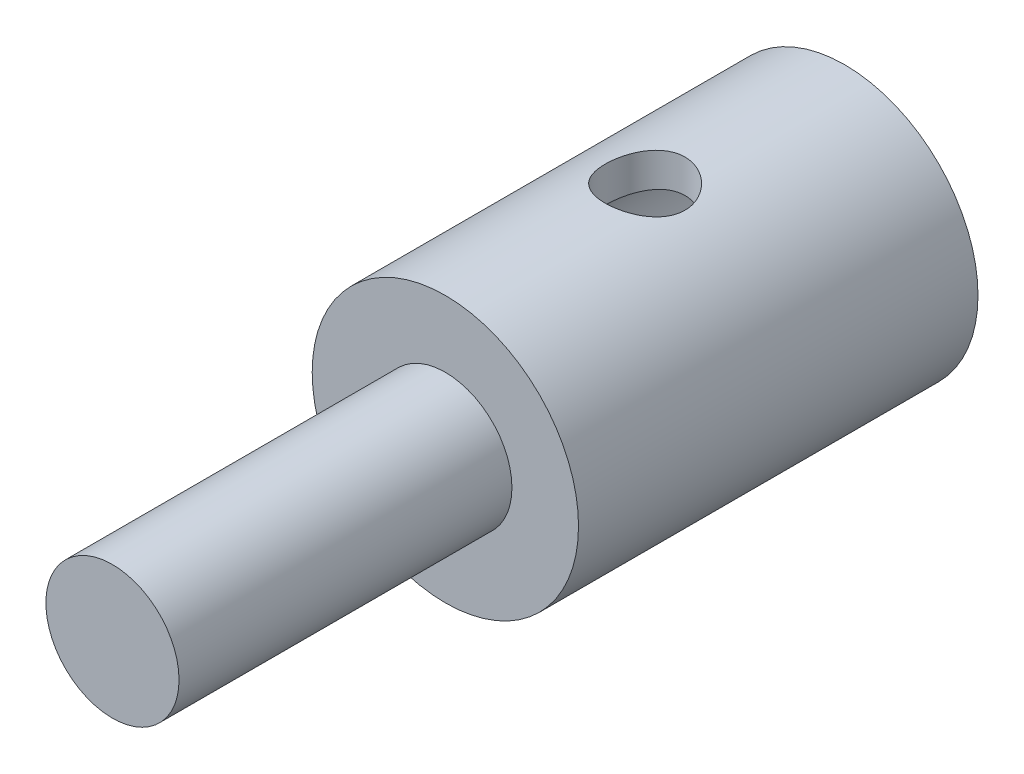
ISO-10303-21;
HEADER;
FILE_DESCRIPTION(('STEP AP214'),'2;1');
FILE_NAME('part.step','',(''),(''),'','','');
FILE_SCHEMA(('AUTOMOTIVE_DESIGN { 1 0 10303 214 1 1 1 1 }'));
ENDSEC;
DATA;
#1=APPLICATION_CONTEXT('core data for automotive mechanical design processes');
#2=APPLICATION_PROTOCOL_DEFINITION('international standard','automotive_design',2000,#1);
#3=PRODUCT_CONTEXT('',#1,'mechanical');
#4=PRODUCT('Part','Part','',(#3));
#5=PRODUCT_RELATED_PRODUCT_CATEGORY('part','',(#4));
#6=PRODUCT_DEFINITION_FORMATION('','',#4);
#7=PRODUCT_DEFINITION_CONTEXT('part definition',#1,'design');
#8=PRODUCT_DEFINITION('design','',#6,#7);
#9=PRODUCT_DEFINITION_SHAPE('','',#8);
#10=(LENGTH_UNIT() NAMED_UNIT(*) SI_UNIT(.MILLI.,.METRE.));
#11=(NAMED_UNIT(*) PLANE_ANGLE_UNIT() SI_UNIT($,.RADIAN.));
#12=(NAMED_UNIT(*) SI_UNIT($,.STERADIAN.) SOLID_ANGLE_UNIT());
#13=UNCERTAINTY_MEASURE_WITH_UNIT(LENGTH_MEASURE(1.E-05),#10,'distance_accuracy_value','');
#14=(GEOMETRIC_REPRESENTATION_CONTEXT(3) GLOBAL_UNCERTAINTY_ASSIGNED_CONTEXT((#13)) GLOBAL_UNIT_ASSIGNED_CONTEXT((#10,
#11,#12)) REPRESENTATION_CONTEXT('',''));
#15=CARTESIAN_POINT('',(0.,0.,0.));
#16=DIRECTION('',(0.,0.,1.));
#17=DIRECTION('',(1.,0.,0.));
#18=AXIS2_PLACEMENT_3D('',#15,#16,#17);
#19=CARTESIAN_POINT('',(0.,0.,5.5));
#20=DIRECTION('',(0.,0.,-1.));
#21=DIRECTION('',(-1.,0.,0.));
#22=AXIS2_PLACEMENT_3D('',#19,#20,#21);
#23=PLANE('',#22);
#24=CARTESIAN_POINT('',(0.,0.,5.5));
#25=DIRECTION('',(0.,0.,1.));
#26=DIRECTION('',(1.,0.,0.));
#27=AXIS2_PLACEMENT_3D('',#24,#25,#26);
#28=CIRCLE('',#27,1.);
#29=CARTESIAN_POINT('',(1.,0.,5.5));
#30=VERTEX_POINT('',#29);
#31=EDGE_CURVE('E10',#30,#30,#28,.T.);
#32=ORIENTED_EDGE('',*,*,#31,.T.);
#33=EDGE_LOOP('',(#32));
#34=FACE_BOUND('',#33,.T.);
#35=ADVANCED_FACE('F31',(#34),#23,.F.);
#36=CARTESIAN_POINT('',(0.,0.,5.5));
#37=DIRECTION('',(0.,0.,1.));
#38=DIRECTION('',(1.,0.,0.));
#39=AXIS2_PLACEMENT_3D('',#36,#37,#38);
#40=CYLINDRICAL_SURFACE('',#39,1.);
#41=ORIENTED_EDGE('',*,*,#31,.F.);
#42=EDGE_LOOP('',(#41));
#43=FACE_BOUND('',#42,.T.);
#44=CARTESIAN_POINT('',(0.,0.,0.5));
#45=DIRECTION('',(0.,0.,1.));
#46=DIRECTION('',(1.,0.,0.));
#47=AXIS2_PLACEMENT_3D('',#44,#45,#46);
#48=CIRCLE('',#47,1.);
#49=CARTESIAN_POINT('',(1.,0.,0.5));
#50=VERTEX_POINT('',#49);
#51=EDGE_CURVE('E43',#50,#50,#48,.T.);
#52=ORIENTED_EDGE('',*,*,#51,.T.);
#53=EDGE_LOOP('',(#52));
#54=FACE_BOUND('',#53,.T.);
#55=ADVANCED_FACE('F91',(#43,#54),#40,.T.);
#56=CARTESIAN_POINT('',(0.,1.,0.5));
#57=DIRECTION('',(0.,0.,-1.));
#58=DIRECTION('',(-1.,0.,0.));
#59=AXIS2_PLACEMENT_3D('',#56,#57,#58);
#60=PLANE('',#59);
#61=ORIENTED_EDGE('',*,*,#51,.F.);
#62=EDGE_LOOP('',(#61));
#63=FACE_BOUND('',#62,.T.);
#64=CARTESIAN_POINT('',(0.,0.,0.5));
#65=DIRECTION('',(0.,0.,1.));
#66=DIRECTION('',(1.,0.,0.));
#67=AXIS2_PLACEMENT_3D('',#64,#65,#66);
#68=CIRCLE('',#67,2.);
#69=CARTESIAN_POINT('',(2.,0.,0.5));
#70=VERTEX_POINT('',#69);
#71=EDGE_CURVE('E48',#70,#70,#68,.T.);
#72=ORIENTED_EDGE('',*,*,#71,.T.);
#73=EDGE_LOOP('',(#72));
#74=FACE_BOUND('',#73,.T.);
#75=ADVANCED_FACE('F87',(#63,#74),#60,.F.);
#76=CARTESIAN_POINT('',(0.,0.,5.5));
#77=DIRECTION('',(0.,0.,1.));
#78=DIRECTION('',(1.,0.,0.));
#79=AXIS2_PLACEMENT_3D('',#76,#77,#78);
#80=CYLINDRICAL_SURFACE('',#79,2.);
#81=CARTESIAN_POINT('',(0.,-2.,-1.9));
#82=CARTESIAN_POINT('',(0.03291544510132,-1.9999997170022,-1.90000039899395));
#83=CARTESIAN_POINT('',(0.0658349273406118,-1.99917966277583,-1.90271754544959));
#84=CARTESIAN_POINT('',(0.130715250121952,-1.99598842237475,-1.91348854168884));
#85=CARTESIAN_POINT('',(0.162675801764568,-1.99361677355871,-1.92154398320933));
#86=CARTESIAN_POINT('',(0.224693083101811,-1.9875822100074,-1.94269840676411));
#87=CARTESIAN_POINT('',(0.25475254575815,-1.98392120100191,-1.95578994784758));
#88=CARTESIAN_POINT('',(0.312249672421251,-1.97568843695037,-1.98661443722233));
#89=CARTESIAN_POINT('',(0.339686986987863,-1.97111656076748,-2.00434800295814));
#90=CARTESIAN_POINT('',(0.391948718873502,-1.96140294877191,-2.0444896029891));
#91=CARTESIAN_POINT('',(0.416687228497752,-1.9562495346312,-2.06700665035448));
#92=CARTESIAN_POINT('',(0.462099683693279,-1.94602333683871,-2.11584369196396));
#93=CARTESIAN_POINT('',(0.482772945309704,-1.94095056688659,-2.14216432484956));
#94=CARTESIAN_POINT('',(0.51992015089489,-1.93133645598676,-2.19858830121547));
#95=CARTESIAN_POINT('',(0.53628923608908,-1.92680962669952,-2.22876338439792));
#96=CARTESIAN_POINT('',(0.563685579098815,-1.91897448153211,-2.2915957016905));
#97=CARTESIAN_POINT('',(0.574714119679048,-1.91566587308889,-2.32425233756513));
#98=CARTESIAN_POINT('',(0.590806534730252,-1.91076348351385,-2.39015610645326));
#99=CARTESIAN_POINT('',(0.596028784940188,-1.90912427788711,-2.42336109755742));
#100=CARTESIAN_POINT('',(0.600854922460317,-1.90761115958514,-2.4902132625011));
#101=CARTESIAN_POINT('',(0.600460171044287,-1.90773681919679,-2.52386032722981));
#102=CARTESIAN_POINT('',(0.594187908798803,-1.90969897612233,-2.58935356344235));
#103=CARTESIAN_POINT('',(0.588508821050622,-1.91147355435668,-2.62122090014461));
#104=CARTESIAN_POINT('',(0.572149681708343,-1.91643342495439,-2.68352791450966));
#105=CARTESIAN_POINT('',(0.561469136566596,-1.91961885654016,-2.71396745094981));
#106=CARTESIAN_POINT('',(0.535264106614694,-1.92709093228899,-2.77304013986422));
#107=CARTESIAN_POINT('',(0.519675267738561,-1.93139206446088,-2.80164283358208));
#108=CARTESIAN_POINT('',(0.484140890354742,-1.94060394800318,-2.8558928088041));
#109=CARTESIAN_POINT('',(0.464194296010356,-1.94551484698876,-2.88153937176552));
#110=CARTESIAN_POINT('',(0.419525163062183,-1.95564404519092,-2.9302744763048));
#111=CARTESIAN_POINT('',(0.394637962986788,-1.96086661724177,-2.95321146561187));
#112=CARTESIAN_POINT('',(0.341305303725588,-1.97084897625326,-2.9946215936257));
#113=CARTESIAN_POINT('',(0.312859620744355,-1.9756087340737,-3.01309445136577));
#114=CARTESIAN_POINT('',(0.252942015337121,-1.98417264027782,-3.04514396898589));
#115=CARTESIAN_POINT('',(0.22145109989918,-1.98797017467324,-3.05868700649994));
#116=CARTESIAN_POINT('',(0.156498166241408,-1.9941340873289,-3.08023983603985));
#117=CARTESIAN_POINT('',(0.123036700635833,-1.996500864748,-3.088251171413));
#118=CARTESIAN_POINT('',(0.0563808970673328,-1.99947345857415,-3.09826087115976));
#119=CARTESIAN_POINT('',(0.0232200390404747,-2.00013940167117,-3.10046463432064));
#120=CARTESIAN_POINT('',(-0.0429998423293526,-1.99981169296703,-3.09937233771517));
#121=CARTESIAN_POINT('',(-0.0760588786763108,-1.99881826271098,-3.09607701213943));
#122=CARTESIAN_POINT('',(-0.14036144212388,-1.99532278794869,-3.0842461555554));
#123=CARTESIAN_POINT('',(-0.171629109045672,-1.99285531919782,-3.07583064496764));
#124=CARTESIAN_POINT('',(-0.232301855581804,-1.98669739136598,-3.05414270688873));
#125=CARTESIAN_POINT('',(-0.261706710810217,-1.98300678528377,-3.0408696955849));
#126=CARTESIAN_POINT('',(-0.318574875784438,-1.97467861740588,-3.0094987338075));
#127=CARTESIAN_POINT('',(-0.345977530479931,-1.97002112332088,-2.99129626362064));
#128=CARTESIAN_POINT('',(-0.397409323191996,-1.96029387505509,-2.95071009837904));
#129=CARTESIAN_POINT('',(-0.421437612942137,-1.95522401771617,-2.92832535524556));
#130=CARTESIAN_POINT('',(-0.466342978204352,-1.94501268748499,-2.87904507665161));
#131=CARTESIAN_POINT('',(-0.487073924926943,-1.93987530016511,-2.85201524968884));
#132=CARTESIAN_POINT('',(-0.523715980287685,-1.93030606092181,-2.79474882439705));
#133=CARTESIAN_POINT('',(-0.539627215314416,-1.92587419049889,-2.76451231018591));
#134=CARTESIAN_POINT('',(-0.566069388510893,-1.91826875857973,-2.7017870034919));
#135=CARTESIAN_POINT('',(-0.576625387759089,-1.91508935181965,-2.66930952535736));
#136=CARTESIAN_POINT('',(-0.592086923271644,-1.91036637789379,-2.60292481239779));
#137=CARTESIAN_POINT('',(-0.596994395917994,-1.90882225014947,-2.56901807167547));
#138=CARTESIAN_POINT('',(-0.600887937937676,-1.90759988987286,-2.5022553926552));
#139=CARTESIAN_POINT('',(-0.600112221233274,-1.90784658974116,-2.46941453959449));
#140=CARTESIAN_POINT('',(-0.593230021779939,-1.90999760518304,-2.40435435864936));
#141=CARTESIAN_POINT('',(-0.587123752499047,-1.91190185437816,-2.37213500592905));
#142=CARTESIAN_POINT('',(-0.569907555216364,-1.91710305467369,-2.30962184034326));
#143=CARTESIAN_POINT('',(-0.558860702028225,-1.92038241818175,-2.27930908505543));
#144=CARTESIAN_POINT('',(-0.532126028484565,-1.92796111563865,-2.2209430244728));
#145=CARTESIAN_POINT('',(-0.516437319851518,-1.93226064477782,-2.19289015294367));
#146=CARTESIAN_POINT('',(-0.480195055220275,-1.94159070570274,-2.13873475338919));
#147=CARTESIAN_POINT('',(-0.459485104371971,-1.94664216065503,-2.11274049549584));
#148=CARTESIAN_POINT('',(-0.414069738519131,-1.95680528180026,-2.06451900067685));
#149=CARTESIAN_POINT('',(-0.389363286853802,-1.96191696329566,-2.0422927442129));
#150=CARTESIAN_POINT('',(-0.335786304873299,-1.97180374628255,-2.00159063508199));
#151=CARTESIAN_POINT('',(-0.306815154316243,-1.97656463906268,-1.98324342125781));
#152=CARTESIAN_POINT('',(-0.246056549593412,-1.98504272182326,-1.95170593203839));
#153=CARTESIAN_POINT('',(-0.214270421199582,-1.98876039972427,-1.9385132446902));
#154=CARTESIAN_POINT('',(-0.152303085062113,-1.9944086998772,-1.9188418897389));
#155=CARTESIAN_POINT('',(-0.122314784781694,-1.99648810952427,-1.9117953308467));
#156=CARTESIAN_POINT('',(-0.0615520780923119,-1.99928377797797,-1.90237458990337));
#157=CARTESIAN_POINT('',(-0.0307778039432559,-2.00000026461896,-1.89999962691807));
#158=CARTESIAN_POINT('',(0.,-2.,-1.9));
#159=B_SPLINE_CURVE_WITH_KNOTS('',3,(#81,#82,#83,#84,#85,#86,#87,#88,#89,#90,#91,#92,#93,#94,
#95,#96,#97,#98,#99,#100,#101,#102,#103,#104,#105,#106,#107,#108,#109,#110,#111,#112,#113,#114,
#115,#116,#117,#118,#119,#120,#121,#122,#123,#124,#125,#126,#127,#128,#129,#130,#131,#132,#133,
#134,#135,#136,#137,#138,#139,#140,#141,#142,#143,#144,#145,#146,#147,#148,#149,#150,#151,#152,
#153,#154,#155,#156,#157,#158),.UNSPECIFIED.,.T.,.F.,(4,2,2,2,2,2,2,2,2,2,2,2,2,2,2,2,2,2,2,2,2,
2,2,2,2,2,2,2,2,2,2,2,2,2,2,2,2,2,4),(0.,0.0986332814450441,0.1972959859384,0.29581347052035,
0.39434406576508,0.495422411792766,0.596517749154532,0.699885924016436,0.803229258172894,
0.903678757411506,1.00410391324614,1.10090406676049,1.19771377460179,1.29584970575826,
1.39400944060401,1.49626841616245,1.59853382609407,1.70148418749654,1.80440581408502,
1.90363523772396,2.00285141417109,2.09982698669909,2.1968142183447,2.29604522278142,
2.39530112797055,2.49816160126106,2.60101937698051,2.70339125976521,2.80572803779072,
2.90380062181736,3.00186927859599,3.09872016156048,3.19558959016202,3.29598770266932,
3.3964118995396,3.49977198457628,3.60308364633053,3.69532676767143,3.78755446774509),.UNSPECIFIED.);
#160=CARTESIAN_POINT('',(0.,-2.,-1.9));
#161=VERTEX_POINT('',#160);
#162=EDGE_CURVE('E77',#161,#161,#159,.T.);
#163=ORIENTED_EDGE('',*,*,#162,.T.);
#164=EDGE_LOOP('',(#163));
#165=FACE_BOUND('',#164,.T.);
#166=CARTESIAN_POINT('',(0.,2.,-1.9));
#167=CARTESIAN_POINT('',(-0.03291544510132,1.9999997170022,-1.90000039899395));
#168=CARTESIAN_POINT('',(-0.0658349273406118,1.99917966277583,-1.90271754544959));
#169=CARTESIAN_POINT('',(-0.130715250121952,1.99598842237475,-1.91348854168884));
#170=CARTESIAN_POINT('',(-0.162675801764568,1.99361677355871,-1.92154398320933));
#171=CARTESIAN_POINT('',(-0.224693083101811,1.9875822100074,-1.94269840676411));
#172=CARTESIAN_POINT('',(-0.25475254575815,1.98392120100191,-1.95578994784758));
#173=CARTESIAN_POINT('',(-0.312249672421251,1.97568843695037,-1.98661443722233));
#174=CARTESIAN_POINT('',(-0.339686986987863,1.97111656076748,-2.00434800295814));
#175=CARTESIAN_POINT('',(-0.391948718873502,1.96140294877191,-2.0444896029891));
#176=CARTESIAN_POINT('',(-0.416687228497752,1.9562495346312,-2.06700665035448));
#177=CARTESIAN_POINT('',(-0.462099683693279,1.94602333683871,-2.11584369196396));
#178=CARTESIAN_POINT('',(-0.482772945309704,1.94095056688659,-2.14216432484956));
#179=CARTESIAN_POINT('',(-0.51992015089489,1.93133645598676,-2.19858830121547));
#180=CARTESIAN_POINT('',(-0.53628923608908,1.92680962669952,-2.22876338439792));
#181=CARTESIAN_POINT('',(-0.563685579098815,1.91897448153211,-2.2915957016905));
#182=CARTESIAN_POINT('',(-0.574714119679048,1.91566587308889,-2.32425233756513));
#183=CARTESIAN_POINT('',(-0.590806534730252,1.91076348351385,-2.39015610645326));
#184=CARTESIAN_POINT('',(-0.596028784940188,1.90912427788711,-2.42336109755742));
#185=CARTESIAN_POINT('',(-0.600854922460317,1.90761115958514,-2.4902132625011));
#186=CARTESIAN_POINT('',(-0.600460171044287,1.90773681919679,-2.52386032722981));
#187=CARTESIAN_POINT('',(-0.594187908798803,1.90969897612233,-2.58935356344235));
#188=CARTESIAN_POINT('',(-0.588508821050622,1.91147355435668,-2.62122090014461));
#189=CARTESIAN_POINT('',(-0.572149681708343,1.91643342495439,-2.68352791450966));
#190=CARTESIAN_POINT('',(-0.561469136566596,1.91961885654016,-2.71396745094981));
#191=CARTESIAN_POINT('',(-0.535264106614694,1.92709093228899,-2.77304013986422));
#192=CARTESIAN_POINT('',(-0.519675267738561,1.93139206446088,-2.80164283358208));
#193=CARTESIAN_POINT('',(-0.484140890354742,1.94060394800318,-2.8558928088041));
#194=CARTESIAN_POINT('',(-0.464194296010356,1.94551484698876,-2.88153937176552));
#195=CARTESIAN_POINT('',(-0.419525163062183,1.95564404519092,-2.9302744763048));
#196=CARTESIAN_POINT('',(-0.394637962986788,1.96086661724177,-2.95321146561187));
#197=CARTESIAN_POINT('',(-0.341305303725588,1.97084897625326,-2.9946215936257));
#198=CARTESIAN_POINT('',(-0.312859620744355,1.9756087340737,-3.01309445136577));
#199=CARTESIAN_POINT('',(-0.252942015337121,1.98417264027782,-3.04514396898589));
#200=CARTESIAN_POINT('',(-0.22145109989918,1.98797017467324,-3.05868700649994));
#201=CARTESIAN_POINT('',(-0.156498166241408,1.9941340873289,-3.08023983603985));
#202=CARTESIAN_POINT('',(-0.123036700635833,1.996500864748,-3.088251171413));
#203=CARTESIAN_POINT('',(-0.0563808970673328,1.99947345857415,-3.09826087115976));
#204=CARTESIAN_POINT('',(-0.0232200390404747,2.00013940167117,-3.10046463432064));
#205=CARTESIAN_POINT('',(0.0429998423293526,1.99981169296703,-3.09937233771517));
#206=CARTESIAN_POINT('',(0.0760588786763108,1.99881826271098,-3.09607701213943));
#207=CARTESIAN_POINT('',(0.14036144212388,1.99532278794869,-3.0842461555554));
#208=CARTESIAN_POINT('',(0.171629109045672,1.99285531919782,-3.07583064496764));
#209=CARTESIAN_POINT('',(0.232301855581804,1.98669739136598,-3.05414270688873));
#210=CARTESIAN_POINT('',(0.261706710810217,1.98300678528377,-3.0408696955849));
#211=CARTESIAN_POINT('',(0.318574875784438,1.97467861740588,-3.0094987338075));
#212=CARTESIAN_POINT('',(0.345977530479931,1.97002112332088,-2.99129626362064));
#213=CARTESIAN_POINT('',(0.397409323191996,1.96029387505509,-2.95071009837904));
#214=CARTESIAN_POINT('',(0.421437612942137,1.95522401771617,-2.92832535524556));
#215=CARTESIAN_POINT('',(0.466342978204352,1.94501268748499,-2.87904507665161));
#216=CARTESIAN_POINT('',(0.487073924926943,1.93987530016511,-2.85201524968884));
#217=CARTESIAN_POINT('',(0.523715980287685,1.93030606092181,-2.79474882439705));
#218=CARTESIAN_POINT('',(0.539627215314416,1.92587419049889,-2.76451231018591));
#219=CARTESIAN_POINT('',(0.566069388510893,1.91826875857973,-2.7017870034919));
#220=CARTESIAN_POINT('',(0.576625387759089,1.91508935181965,-2.66930952535736));
#221=CARTESIAN_POINT('',(0.592086923271644,1.91036637789379,-2.60292481239779));
#222=CARTESIAN_POINT('',(0.596994395917994,1.90882225014947,-2.56901807167547));
#223=CARTESIAN_POINT('',(0.600887937937676,1.90759988987286,-2.5022553926552));
#224=CARTESIAN_POINT('',(0.600112221233274,1.90784658974116,-2.46941453959449));
#225=CARTESIAN_POINT('',(0.593230021779939,1.90999760518304,-2.40435435864936));
#226=CARTESIAN_POINT('',(0.587123752499047,1.91190185437816,-2.37213500592905));
#227=CARTESIAN_POINT('',(0.569907555216364,1.91710305467369,-2.30962184034326));
#228=CARTESIAN_POINT('',(0.558860702028225,1.92038241818175,-2.27930908505543));
#229=CARTESIAN_POINT('',(0.532126028484565,1.92796111563865,-2.2209430244728));
#230=CARTESIAN_POINT('',(0.516437319851518,1.93226064477782,-2.19289015294367));
#231=CARTESIAN_POINT('',(0.480195055220275,1.94159070570274,-2.13873475338919));
#232=CARTESIAN_POINT('',(0.459485104371971,1.94664216065503,-2.11274049549584));
#233=CARTESIAN_POINT('',(0.414069738519131,1.95680528180026,-2.06451900067685));
#234=CARTESIAN_POINT('',(0.389363286853802,1.96191696329566,-2.0422927442129));
#235=CARTESIAN_POINT('',(0.335786304873299,1.97180374628255,-2.00159063508199));
#236=CARTESIAN_POINT('',(0.306815154316243,1.97656463906268,-1.98324342125781));
#237=CARTESIAN_POINT('',(0.246056549593412,1.98504272182326,-1.95170593203839));
#238=CARTESIAN_POINT('',(0.214270421199582,1.98876039972427,-1.9385132446902));
#239=CARTESIAN_POINT('',(0.152303085062113,1.9944086998772,-1.9188418897389));
#240=CARTESIAN_POINT('',(0.122314784781694,1.99648810952427,-1.9117953308467));
#241=CARTESIAN_POINT('',(0.0615520780923119,1.99928377797797,-1.90237458990337));
#242=CARTESIAN_POINT('',(0.0307778039432559,2.00000026461896,-1.89999962691807));
#243=CARTESIAN_POINT('',(0.,2.,-1.9));
#244=B_SPLINE_CURVE_WITH_KNOTS('',3,(#166,#167,#168,#169,#170,#171,#172,#173,#174,#175,#176,
#177,#178,#179,#180,#181,#182,#183,#184,#185,#186,#187,#188,#189,#190,#191,#192,#193,#194,#195,
#196,#197,#198,#199,#200,#201,#202,#203,#204,#205,#206,#207,#208,#209,#210,#211,#212,#213,#214,
#215,#216,#217,#218,#219,#220,#221,#222,#223,#224,#225,#226,#227,#228,#229,#230,#231,#232,#233,
#234,#235,#236,#237,#238,#239,#240,#241,#242,#243),.UNSPECIFIED.,.T.,.F.,(4,2,2,2,2,2,2,2,2,2,2,
2,2,2,2,2,2,2,2,2,2,2,2,2,2,2,2,2,2,2,2,2,2,2,2,2,2,2,4),(0.,0.0986332814450441,0.1972959859384,
0.29581347052035,0.39434406576508,0.495422411792766,0.596517749154532,0.699885924016436,
0.803229258172894,0.903678757411506,1.00410391324614,1.10090406676049,1.19771377460179,
1.29584970575826,1.39400944060401,1.49626841616245,1.59853382609407,1.70148418749654,
1.80440581408502,1.90363523772396,2.00285141417109,2.09982698669909,2.1968142183447,
2.29604522278142,2.39530112797055,2.49816160126106,2.60101937698051,2.70339125976521,
2.80572803779072,2.90380062181736,3.00186927859599,3.09872016156048,3.19558959016202,
3.29598770266932,3.3964118995396,3.49977198457628,3.60308364633053,3.69532676767143,
3.78755446774509),.UNSPECIFIED.);
#245=CARTESIAN_POINT('',(0.,2.,-1.9));
#246=VERTEX_POINT('',#245);
#247=EDGE_CURVE('E71',#246,#246,#244,.T.);
#248=ORIENTED_EDGE('',*,*,#247,.T.);
#249=EDGE_LOOP('',(#248));
#250=FACE_BOUND('',#249,.T.);
#251=ORIENTED_EDGE('',*,*,#71,.F.);
#252=EDGE_LOOP('',(#251));
#253=FACE_BOUND('',#252,.T.);
#254=CARTESIAN_POINT('',(0.,0.,-5.5));
#255=DIRECTION('',(0.,0.,1.));
#256=DIRECTION('',(1.,0.,0.));
#257=AXIS2_PLACEMENT_3D('',#254,#255,#256);
#258=CIRCLE('',#257,2.);
#259=CARTESIAN_POINT('',(2.,0.,-5.5));
#260=VERTEX_POINT('',#259);
#261=EDGE_CURVE('E104',#260,#260,#258,.T.);
#262=ORIENTED_EDGE('',*,*,#261,.T.);
#263=EDGE_LOOP('',(#262));
#264=FACE_BOUND('',#263,.T.);
#265=ADVANCED_FACE('F82',(#165,#250,#253,#264),#80,.T.);
#266=CARTESIAN_POINT('',(0.,2.,-5.5));
#267=DIRECTION('',(0.,0.,1.));
#268=DIRECTION('',(1.,0.,0.));
#269=AXIS2_PLACEMENT_3D('',#266,#267,#268);
#270=PLANE('',#269);
#271=ORIENTED_EDGE('',*,*,#261,.F.);
#272=EDGE_LOOP('',(#271));
#273=FACE_BOUND('',#272,.T.);
#274=CARTESIAN_POINT('',(0.,0.,-5.5));
#275=DIRECTION('',(0.,0.,1.));
#276=DIRECTION('',(1.,0.,0.));
#277=AXIS2_PLACEMENT_3D('',#274,#275,#276);
#278=CIRCLE('',#277,1.5);
#279=CARTESIAN_POINT('',(1.5,0.,-5.5));
#280=VERTEX_POINT('',#279);
#281=EDGE_CURVE('E106',#280,#280,#278,.T.);
#282=ORIENTED_EDGE('',*,*,#281,.T.);
#283=EDGE_LOOP('',(#282));
#284=FACE_BOUND('',#283,.T.);
#285=ADVANCED_FACE('F86',(#273,#284),#270,.F.);
#286=CARTESIAN_POINT('',(0.,0.,5.5));
#287=DIRECTION('',(0.,0.,1.));
#288=DIRECTION('',(1.,0.,0.));
#289=AXIS2_PLACEMENT_3D('',#286,#287,#288);
#290=CYLINDRICAL_SURFACE('',#289,1.5);
#291=CARTESIAN_POINT('',(0.,-1.5,-1.9));
#292=CARTESIAN_POINT('',(-0.0322479016328674,-1.49999781368125,-1.90000295554712));
#293=CARTESIAN_POINT('',(-0.0645517692272019,-1.4989478829208,-1.90261532562651));
#294=CARTESIAN_POINT('',(-0.128248944125369,-1.49485035930193,-1.91297431105637));
#295=CARTESIAN_POINT('',(-0.159639533268374,-1.49179733609663,-1.92073488372584));
#296=CARTESIAN_POINT('',(-0.220486176818221,-1.48402262763936,-1.94106282341765));
#297=CARTESIAN_POINT('',(-0.249948198485087,-1.47930640909222,-1.95361445386502));
#298=CARTESIAN_POINT('',(-0.30632159109851,-1.46866983238823,-1.98310575199796));
#299=CARTESIAN_POINT('',(-0.333233843025297,-1.46274989237417,-2.00004389647568));
#300=CARTESIAN_POINT('',(-0.385050302271118,-1.44999265851126,-2.03867064956828));
#301=CARTESIAN_POINT('',(-0.409818681765064,-1.44312689078757,-2.06053199687208));
#302=CARTESIAN_POINT('',(-0.455452501435416,-1.42938173071858,-2.10802000104303));
#303=CARTESIAN_POINT('',(-0.476316032140059,-1.42250233336138,-2.13364848916352));
#304=CARTESIAN_POINT('',(-0.514462370187863,-1.40916837539141,-2.18932842107268));
#305=CARTESIAN_POINT('',(-0.531544494358642,-1.40274634789485,-2.21952594580696));
#306=CARTESIAN_POINT('',(-0.560326415711144,-1.39150094156038,-2.28266091952601));
#307=CARTESIAN_POINT('',(-0.57202876928575,-1.38667680373253,-2.31559705835451));
#308=CARTESIAN_POINT('',(-0.58916964701876,-1.37947907298246,-2.38171370007763));
#309=CARTESIAN_POINT('',(-0.594868189741694,-1.37700426106682,-2.41481537067286));
#310=CARTESIAN_POINT('',(-0.600651888492009,-1.37449201214743,-2.48159049949218));
#311=CARTESIAN_POINT('',(-0.600739804893967,-1.37445337656831,-2.5152636683875));
#312=CARTESIAN_POINT('',(-0.595496810251363,-1.37673150083998,-2.57972700143741));
#313=CARTESIAN_POINT('',(-0.590542594291541,-1.37888452511535,-2.61055471432271));
#314=CARTESIAN_POINT('',(-0.575984064089346,-1.38502856282351,-2.67089786680201));
#315=CARTESIAN_POINT('',(-0.566378938441389,-1.38901989696502,-2.70041307643309));
#316=CARTESIAN_POINT('',(-0.542608419765322,-1.39847845526559,-2.75800535085881));
#317=CARTESIAN_POINT('',(-0.528353958694595,-1.40397413784236,-2.78604077171641));
#318=CARTESIAN_POINT('',(-0.495751938219664,-1.41581434916967,-2.83942474490847));
#319=CARTESIAN_POINT('',(-0.477402841530253,-1.42215919637055,-2.86477228282084));
#320=CARTESIAN_POINT('',(-0.43546517983633,-1.43558021022681,-2.9141229186406));
#321=CARTESIAN_POINT('',(-0.411581238891191,-1.44267499492846,-2.9378706188338));
#322=CARTESIAN_POINT('',(-0.360094328229058,-1.45637947487485,-2.98110534340061));
#323=CARTESIAN_POINT('',(-0.33249061960033,-1.46298907333597,-3.00059151922309));
#324=CARTESIAN_POINT('',(-0.273623295781753,-1.47514404379365,-3.03508523422475));
#325=CARTESIAN_POINT('',(-0.242298147403943,-1.48066581028625,-3.04999668435912));
#326=CARTESIAN_POINT('',(-0.177307129644865,-1.48984448498628,-3.07425035832342));
#327=CARTESIAN_POINT('',(-0.143642459054903,-1.49350234038714,-3.08359541126722));
#328=CARTESIAN_POINT('',(-0.0770687662823457,-1.49836841852074,-3.09593448862591));
#329=CARTESIAN_POINT('',(-0.0442329881956591,-1.49970883750057,-3.09927173627606));
#330=CARTESIAN_POINT('',(0.0215535929423437,-1.50020543553187,-3.10051393015859));
#331=CARTESIAN_POINT('',(0.0545043639671719,-1.49936218074679,-3.09842028446426));
#332=CARTESIAN_POINT('',(0.118029821736601,-1.49567270119134,-3.08911247423439));
#333=CARTESIAN_POINT('',(0.14864474753266,-1.49291817403686,-3.08213260589467));
#334=CARTESIAN_POINT('',(0.208240628418216,-1.48577832421621,-3.06356928750709));
#335=CARTESIAN_POINT('',(0.237221373067387,-1.4813927920685,-3.05198524609952));
#336=CARTESIAN_POINT('',(0.293723635745078,-1.47124978431356,-3.02416451809588));
#337=CARTESIAN_POINT('',(0.321173406826879,-1.46545444794366,-3.00779635838655));
#338=CARTESIAN_POINT('',(0.373033077373709,-1.45312009423233,-2.97101790282881));
#339=CARTESIAN_POINT('',(0.397441752227376,-1.44658077931494,-2.9506059871251));
#340=CARTESIAN_POINT('',(0.44421691290967,-1.43293535293125,-2.9047389961131));
#341=CARTESIAN_POINT('',(0.46634218014576,-1.42582032434024,-2.87903993754041));
#342=CARTESIAN_POINT('',(0.506025359220172,-1.4122250186863,-2.82416797510492));
#343=CARTESIAN_POINT('',(0.52358251838651,-1.40574484633605,-2.79499449992693));
#344=CARTESIAN_POINT('',(0.553742250590837,-1.39414289997032,-2.73356149159978));
#345=CARTESIAN_POINT('',(0.56629517841029,-1.3890348935785,-2.70127480014192));
#346=CARTESIAN_POINT('',(0.585688865962333,-1.38097102135267,-2.63477990438705));
#347=CARTESIAN_POINT('',(0.592533841593995,-1.37801356732559,-2.60057313822623));
#348=CARTESIAN_POINT('',(0.599914685172235,-1.37481527767886,-2.53386162948679));
#349=CARTESIAN_POINT('',(0.60086912468784,-1.3743942629654,-2.50141154812712));
#350=CARTESIAN_POINT('',(0.597540947786276,-1.3758445081584,-2.43683654268089));
#351=CARTESIAN_POINT('',(0.593258996374929,-1.37771547698992,-2.40471157782788));
#352=CARTESIAN_POINT('',(0.579921409845332,-1.38337994722213,-2.34300034304478));
#353=CARTESIAN_POINT('',(0.571061248071088,-1.38709449547834,-2.31336391767045));
#354=CARTESIAN_POINT('',(0.549001634547508,-1.3959720037021,-2.25598641111561));
#355=CARTESIAN_POINT('',(0.5358009844182,-1.40113536361912,-2.22824585592996));
#356=CARTESIAN_POINT('',(0.504561828827859,-1.41269582881231,-2.17371711421887));
#357=CARTESIAN_POINT('',(0.486289600547831,-1.41914664693941,-2.14707439896088));
#358=CARTESIAN_POINT('',(0.445767635781465,-1.43239141311703,-2.09710200483885));
#359=CARTESIAN_POINT('',(0.423516700445441,-1.43918546414531,-2.0737733283615));
#360=CARTESIAN_POINT('',(0.373951651881734,-1.45288070126209,-2.02953914402092));
#361=CARTESIAN_POINT('',(0.34640280034384,-1.45976027388653,-2.00888880793058));
#362=CARTESIAN_POINT('',(0.287970096085735,-1.47240122014118,-1.97249888721351));
#363=CARTESIAN_POINT('',(0.257084701364172,-1.47816207327873,-1.95676158635424));
#364=CARTESIAN_POINT('',(0.193421418748561,-1.48781914444758,-1.93101333544291));
#365=CARTESIAN_POINT('',(0.160689485465909,-1.49174808916508,-1.9209012029319));
#366=CARTESIAN_POINT('',(0.0938629638843664,-1.4974329186281,-1.90640826371372));
#367=CARTESIAN_POINT('',(0.0597730577576739,-1.49919569848691,-1.90200926897683));
#368=CARTESIAN_POINT('',(0.0170736893672789,-1.49992769851241,-1.90018138570652));
#369=CARTESIAN_POINT('',(0.00853880662222754,-1.50000057890753,-1.89999921741124));
#370=CARTESIAN_POINT('',(0.,-1.5,-1.9));
#371=B_SPLINE_CURVE_WITH_KNOTS('',3,(#291,#292,#293,#294,#295,#296,#297,#298,#299,#300,#301,
#302,#303,#304,#305,#306,#307,#308,#309,#310,#311,#312,#313,#314,#315,#316,#317,#318,#319,#320,
#321,#322,#323,#324,#325,#326,#327,#328,#329,#330,#331,#332,#333,#334,#335,#336,#337,#338,#339,
#340,#341,#342,#343,#344,#345,#346,#347,#348,#349,#350,#351,#352,#353,#354,#355,#356,#357,#358,
#359,#360,#361,#362,#363,#364,#365,#366,#367,#368,#369,#370),.UNSPECIFIED.,.T.,.F.,(4,2,2,2,2,2,
2,2,2,2,2,2,2,2,2,2,2,2,2,2,2,2,2,2,2,2,2,2,2,2,2,2,2,2,2,2,2,2,2,4),(0.,0.0967208963679212,
0.19370509080238,0.290373437241474,0.387008260703952,0.487792145101191,0.588625184803234,
0.69394577645765,0.799216269354804,0.899712315926485,1.00015891902146,1.09361498520412,
1.18708736176814,1.28246737889645,1.37788326581455,1.48067504755967,1.5834872785192,
1.68833073948842,1.79312086834137,1.89170755358402,1.99026868071025,2.0844013666931,
2.17854614698139,2.27557054019479,2.37263387849691,2.47610542387324,2.57959400713124,
2.68408513539809,2.78849901788503,2.88539902012547,2.98228671763636,3.07534295559353,
3.16842490736271,3.2668364041173,3.36527760399241,3.47010127054873,3.57497359086883,
3.67789290298718,3.78048375716025,3.80609413763761),.UNSPECIFIED.);
#372=CARTESIAN_POINT('',(0.,-1.5,-1.9));
#373=VERTEX_POINT('',#372);
#374=EDGE_CURVE('E34',#373,#373,#371,.T.);
#375=ORIENTED_EDGE('',*,*,#374,.T.);
#376=EDGE_LOOP('',(#375));
#377=FACE_BOUND('',#376,.T.);
#378=CARTESIAN_POINT('',(0.,1.5,-1.9));
#379=CARTESIAN_POINT('',(0.0322479016328674,1.49999781368125,-1.90000295554712));
#380=CARTESIAN_POINT('',(0.0645517692272019,1.4989478829208,-1.90261532562651));
#381=CARTESIAN_POINT('',(0.128248944125369,1.49485035930193,-1.91297431105637));
#382=CARTESIAN_POINT('',(0.159639533268374,1.49179733609663,-1.92073488372584));
#383=CARTESIAN_POINT('',(0.220486176818221,1.48402262763936,-1.94106282341765));
#384=CARTESIAN_POINT('',(0.249948198485087,1.47930640909222,-1.95361445386502));
#385=CARTESIAN_POINT('',(0.30632159109851,1.46866983238823,-1.98310575199796));
#386=CARTESIAN_POINT('',(0.333233843025297,1.46274989237417,-2.00004389647568));
#387=CARTESIAN_POINT('',(0.385050302271118,1.44999265851126,-2.03867064956828));
#388=CARTESIAN_POINT('',(0.409818681765064,1.44312689078757,-2.06053199687208));
#389=CARTESIAN_POINT('',(0.455452501435416,1.42938173071858,-2.10802000104303));
#390=CARTESIAN_POINT('',(0.476316032140059,1.42250233336138,-2.13364848916352));
#391=CARTESIAN_POINT('',(0.514462370187863,1.40916837539141,-2.18932842107268));
#392=CARTESIAN_POINT('',(0.531544494358642,1.40274634789485,-2.21952594580696));
#393=CARTESIAN_POINT('',(0.560326415711144,1.39150094156038,-2.28266091952601));
#394=CARTESIAN_POINT('',(0.57202876928575,1.38667680373253,-2.31559705835451));
#395=CARTESIAN_POINT('',(0.58916964701876,1.37947907298246,-2.38171370007763));
#396=CARTESIAN_POINT('',(0.594868189741694,1.37700426106682,-2.41481537067286));
#397=CARTESIAN_POINT('',(0.600651888492009,1.37449201214743,-2.48159049949218));
#398=CARTESIAN_POINT('',(0.600739804893967,1.37445337656831,-2.5152636683875));
#399=CARTESIAN_POINT('',(0.595496810251363,1.37673150083998,-2.57972700143741));
#400=CARTESIAN_POINT('',(0.590542594291541,1.37888452511535,-2.61055471432271));
#401=CARTESIAN_POINT('',(0.575984064089346,1.38502856282351,-2.67089786680201));
#402=CARTESIAN_POINT('',(0.566378938441389,1.38901989696502,-2.70041307643309));
#403=CARTESIAN_POINT('',(0.542608419765322,1.39847845526559,-2.75800535085881));
#404=CARTESIAN_POINT('',(0.528353958694595,1.40397413784236,-2.78604077171641));
#405=CARTESIAN_POINT('',(0.495751938219664,1.41581434916967,-2.83942474490847));
#406=CARTESIAN_POINT('',(0.477402841530253,1.42215919637055,-2.86477228282084));
#407=CARTESIAN_POINT('',(0.43546517983633,1.43558021022681,-2.9141229186406));
#408=CARTESIAN_POINT('',(0.411581238891191,1.44267499492846,-2.9378706188338));
#409=CARTESIAN_POINT('',(0.360094328229058,1.45637947487485,-2.98110534340061));
#410=CARTESIAN_POINT('',(0.33249061960033,1.46298907333597,-3.00059151922309));
#411=CARTESIAN_POINT('',(0.273623295781753,1.47514404379365,-3.03508523422475));
#412=CARTESIAN_POINT('',(0.242298147403943,1.48066581028625,-3.04999668435912));
#413=CARTESIAN_POINT('',(0.177307129644865,1.48984448498628,-3.07425035832342));
#414=CARTESIAN_POINT('',(0.143642459054903,1.49350234038714,-3.08359541126722));
#415=CARTESIAN_POINT('',(0.0770687662823457,1.49836841852074,-3.09593448862591));
#416=CARTESIAN_POINT('',(0.0442329881956591,1.49970883750057,-3.09927173627606));
#417=CARTESIAN_POINT('',(-0.0215535929423437,1.50020543553187,-3.10051393015859));
#418=CARTESIAN_POINT('',(-0.0545043639671719,1.49936218074679,-3.09842028446426));
#419=CARTESIAN_POINT('',(-0.118029821736601,1.49567270119134,-3.08911247423439));
#420=CARTESIAN_POINT('',(-0.14864474753266,1.49291817403686,-3.08213260589467));
#421=CARTESIAN_POINT('',(-0.208240628418216,1.48577832421621,-3.06356928750709));
#422=CARTESIAN_POINT('',(-0.237221373067387,1.4813927920685,-3.05198524609952));
#423=CARTESIAN_POINT('',(-0.293723635745078,1.47124978431356,-3.02416451809588));
#424=CARTESIAN_POINT('',(-0.321173406826879,1.46545444794366,-3.00779635838655));
#425=CARTESIAN_POINT('',(-0.373033077373709,1.45312009423233,-2.97101790282881));
#426=CARTESIAN_POINT('',(-0.397441752227376,1.44658077931494,-2.9506059871251));
#427=CARTESIAN_POINT('',(-0.44421691290967,1.43293535293125,-2.9047389961131));
#428=CARTESIAN_POINT('',(-0.46634218014576,1.42582032434024,-2.87903993754041));
#429=CARTESIAN_POINT('',(-0.506025359220172,1.4122250186863,-2.82416797510492));
#430=CARTESIAN_POINT('',(-0.52358251838651,1.40574484633605,-2.79499449992693));
#431=CARTESIAN_POINT('',(-0.553742250590837,1.39414289997032,-2.73356149159978));
#432=CARTESIAN_POINT('',(-0.56629517841029,1.3890348935785,-2.70127480014192));
#433=CARTESIAN_POINT('',(-0.585688865962333,1.38097102135267,-2.63477990438705));
#434=CARTESIAN_POINT('',(-0.592533841593995,1.37801356732559,-2.60057313822623));
#435=CARTESIAN_POINT('',(-0.599914685172235,1.37481527767886,-2.53386162948679));
#436=CARTESIAN_POINT('',(-0.60086912468784,1.3743942629654,-2.50141154812712));
#437=CARTESIAN_POINT('',(-0.597540947786276,1.3758445081584,-2.43683654268089));
#438=CARTESIAN_POINT('',(-0.593258996374929,1.37771547698992,-2.40471157782788));
#439=CARTESIAN_POINT('',(-0.579921409845332,1.38337994722213,-2.34300034304478));
#440=CARTESIAN_POINT('',(-0.571061248071088,1.38709449547834,-2.31336391767045));
#441=CARTESIAN_POINT('',(-0.549001634547508,1.3959720037021,-2.25598641111561));
#442=CARTESIAN_POINT('',(-0.5358009844182,1.40113536361912,-2.22824585592996));
#443=CARTESIAN_POINT('',(-0.504561828827859,1.41269582881231,-2.17371711421887));
#444=CARTESIAN_POINT('',(-0.486289600547831,1.41914664693941,-2.14707439896088));
#445=CARTESIAN_POINT('',(-0.445767635781465,1.43239141311703,-2.09710200483885));
#446=CARTESIAN_POINT('',(-0.423516700445441,1.43918546414531,-2.0737733283615));
#447=CARTESIAN_POINT('',(-0.373951651881734,1.45288070126209,-2.02953914402092));
#448=CARTESIAN_POINT('',(-0.34640280034384,1.45976027388653,-2.00888880793058));
#449=CARTESIAN_POINT('',(-0.287970096085735,1.47240122014118,-1.97249888721351));
#450=CARTESIAN_POINT('',(-0.257084701364172,1.47816207327873,-1.95676158635424));
#451=CARTESIAN_POINT('',(-0.193421418748561,1.48781914444758,-1.93101333544291));
#452=CARTESIAN_POINT('',(-0.160689485465909,1.49174808916508,-1.9209012029319));
#453=CARTESIAN_POINT('',(-0.0938629638843664,1.4974329186281,-1.90640826371372));
#454=CARTESIAN_POINT('',(-0.0597730577576739,1.49919569848691,-1.90200926897683));
#455=CARTESIAN_POINT('',(-0.0170736893672789,1.49992769851241,-1.90018138570652));
#456=CARTESIAN_POINT('',(-0.00853880662222754,1.50000057890753,-1.89999921741124));
#457=CARTESIAN_POINT('',(0.,1.5,-1.9));
#458=B_SPLINE_CURVE_WITH_KNOTS('',3,(#378,#379,#380,#381,#382,#383,#384,#385,#386,#387,#388,
#389,#390,#391,#392,#393,#394,#395,#396,#397,#398,#399,#400,#401,#402,#403,#404,#405,#406,#407,
#408,#409,#410,#411,#412,#413,#414,#415,#416,#417,#418,#419,#420,#421,#422,#423,#424,#425,#426,
#427,#428,#429,#430,#431,#432,#433,#434,#435,#436,#437,#438,#439,#440,#441,#442,#443,#444,#445,
#446,#447,#448,#449,#450,#451,#452,#453,#454,#455,#456,#457),.UNSPECIFIED.,.T.,.F.,(4,2,2,2,2,2,
2,2,2,2,2,2,2,2,2,2,2,2,2,2,2,2,2,2,2,2,2,2,2,2,2,2,2,2,2,2,2,2,2,4),(0.,0.0967208963679212,
0.19370509080238,0.290373437241474,0.387008260703952,0.487792145101191,0.588625184803234,
0.69394577645765,0.799216269354804,0.899712315926485,1.00015891902146,1.09361498520412,
1.18708736176814,1.28246737889645,1.37788326581455,1.48067504755967,1.5834872785192,
1.68833073948842,1.79312086834137,1.89170755358402,1.99026868071025,2.0844013666931,
2.17854614698139,2.27557054019479,2.37263387849691,2.47610542387324,2.57959400713124,
2.68408513539809,2.78849901788503,2.88539902012547,2.98228671763636,3.07534295559353,
3.16842490736271,3.2668364041173,3.36527760399241,3.47010127054873,3.57497359086883,
3.67789290298718,3.78048375716025,3.80609413763761),.UNSPECIFIED.);
#459=CARTESIAN_POINT('',(0.,1.5,-1.9));
#460=VERTEX_POINT('',#459);
#461=EDGE_CURVE('E51',#460,#460,#458,.T.);
#462=ORIENTED_EDGE('',*,*,#461,.T.);
#463=EDGE_LOOP('',(#462));
#464=FACE_BOUND('',#463,.T.);
#465=ORIENTED_EDGE('',*,*,#281,.F.);
#466=EDGE_LOOP('',(#465));
#467=FACE_BOUND('',#466,.T.);
#468=CARTESIAN_POINT('',(0.,0.,-1.5));
#469=DIRECTION('',(0.,0.,1.));
#470=DIRECTION('',(1.,0.,0.));
#471=AXIS2_PLACEMENT_3D('',#468,#469,#470);
#472=CIRCLE('',#471,1.5);
#473=CARTESIAN_POINT('',(1.5,0.,-1.5));
#474=VERTEX_POINT('',#473);
#475=EDGE_CURVE('E110',#474,#474,#472,.T.);
#476=ORIENTED_EDGE('',*,*,#475,.T.);
#477=EDGE_LOOP('',(#476));
#478=FACE_BOUND('',#477,.T.);
#479=ADVANCED_FACE('F56',(#377,#464,#467,#478),#290,.F.);
#480=CARTESIAN_POINT('',(0.,1.5,-1.5));
#481=DIRECTION('',(0.,0.,1.));
#482=DIRECTION('',(1.,0.,0.));
#483=AXIS2_PLACEMENT_3D('',#480,#481,#482);
#484=PLANE('',#483);
#485=ORIENTED_EDGE('',*,*,#475,.F.);
#486=EDGE_LOOP('',(#485));
#487=FACE_BOUND('',#486,.T.);
#488=ADVANCED_FACE('F65',(#487),#484,.F.);
#489=CARTESIAN_POINT('',(0.,-2.,-2.5));
#490=DIRECTION('',(0.,1.,0.));
#491=DIRECTION('',(0.,0.,1.));
#492=AXIS2_PLACEMENT_3D('',#489,#490,#491);
#493=CYLINDRICAL_SURFACE('',#492,0.6);
#494=ORIENTED_EDGE('',*,*,#461,.F.);
#495=EDGE_LOOP('',(#494));
#496=FACE_BOUND('',#495,.T.);
#497=ORIENTED_EDGE('',*,*,#247,.F.);
#498=EDGE_LOOP('',(#497));
#499=FACE_BOUND('',#498,.T.);
#500=ADVANCED_FACE('F63',(#496,#499),#493,.F.);
#501=ORIENTED_EDGE('',*,*,#374,.F.);
#502=EDGE_LOOP('',(#501));
#503=FACE_BOUND('',#502,.T.);
#504=ORIENTED_EDGE('',*,*,#162,.F.);
#505=EDGE_LOOP('',(#504));
#506=FACE_BOUND('',#505,.T.);
#507=ADVANCED_FACE('F60',(#503,#506),#493,.F.);
#508=CLOSED_SHELL('',(#35,#55,#75,#265,#285,#479,#488,#500,#507));
#509=MANIFOLD_SOLID_BREP('B2',#508);
#510=ADVANCED_BREP_SHAPE_REPRESENTATION('',(#18,#509),#14);
#511=SHAPE_DEFINITION_REPRESENTATION(#9,#510);
ENDSEC;
END-ISO-10303-21;
